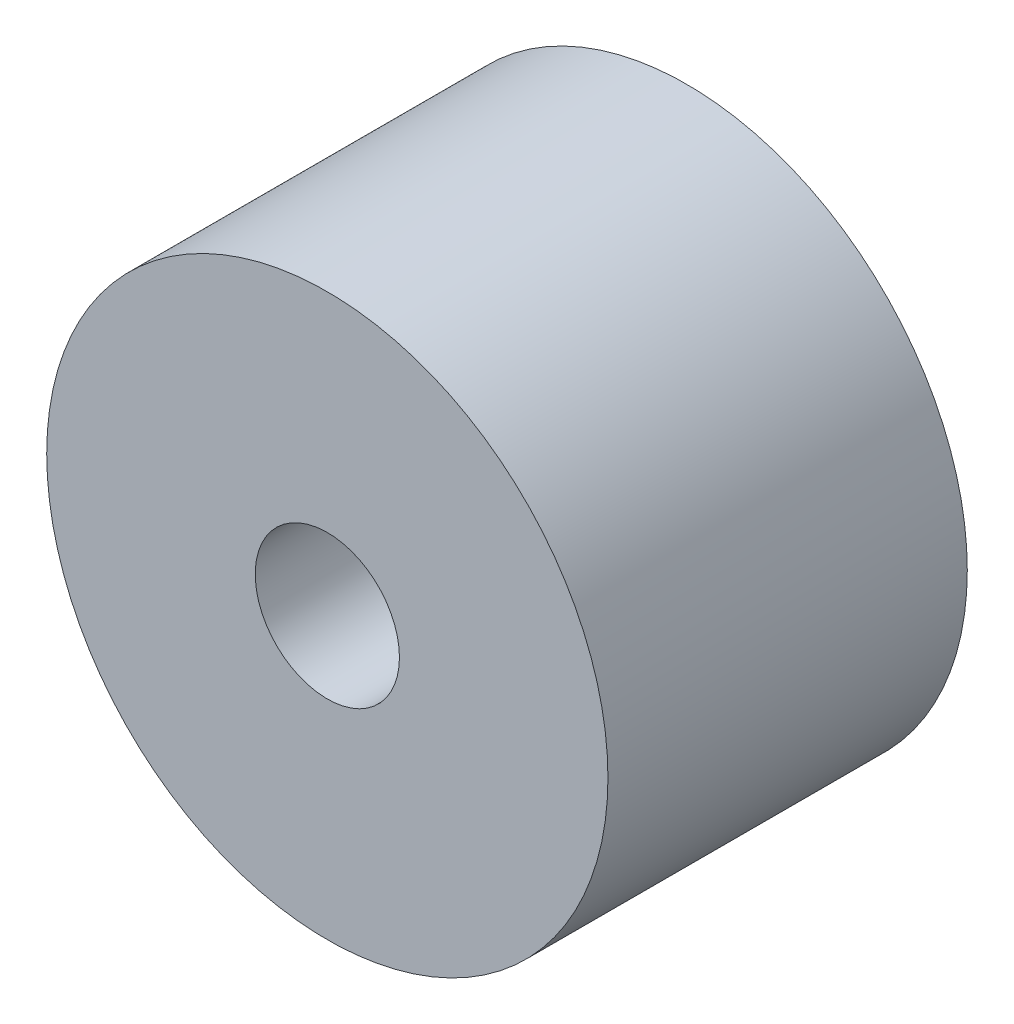
ISO-10303-21;
HEADER;
FILE_DESCRIPTION(('STEP AP214'),'2;1');
FILE_NAME('part.step','',(''),(''),'','','');
FILE_SCHEMA(('AUTOMOTIVE_DESIGN { 1 0 10303 214 1 1 1 1 }'));
ENDSEC;
DATA;
#1=APPLICATION_CONTEXT('core data for automotive mechanical design processes');
#2=APPLICATION_PROTOCOL_DEFINITION('international standard','automotive_design',2000,#1);
#3=PRODUCT_CONTEXT('',#1,'mechanical');
#4=PRODUCT('Part','Part','',(#3));
#5=PRODUCT_RELATED_PRODUCT_CATEGORY('part','',(#4));
#6=PRODUCT_DEFINITION_FORMATION('','',#4);
#7=PRODUCT_DEFINITION_CONTEXT('part definition',#1,'design');
#8=PRODUCT_DEFINITION('design','',#6,#7);
#9=PRODUCT_DEFINITION_SHAPE('','',#8);
#10=(LENGTH_UNIT() NAMED_UNIT(*) SI_UNIT(.MILLI.,.METRE.));
#11=(NAMED_UNIT(*) PLANE_ANGLE_UNIT() SI_UNIT($,.RADIAN.));
#12=(NAMED_UNIT(*) SI_UNIT($,.STERADIAN.) SOLID_ANGLE_UNIT());
#13=UNCERTAINTY_MEASURE_WITH_UNIT(LENGTH_MEASURE(1.E-05),#10,'distance_accuracy_value','');
#14=(GEOMETRIC_REPRESENTATION_CONTEXT(3) GLOBAL_UNCERTAINTY_ASSIGNED_CONTEXT((#13)) GLOBAL_UNIT_ASSIGNED_CONTEXT((#10,
#11,#12)) REPRESENTATION_CONTEXT('',''));
#15=CARTESIAN_POINT('',(0.,0.,0.));
#16=DIRECTION('',(0.,0.,1.));
#17=DIRECTION('',(1.,0.,0.));
#18=AXIS2_PLACEMENT_3D('',#15,#16,#17);
#19=CARTESIAN_POINT('',(0.,0.,2.99));
#20=DIRECTION('',(0.,0.,1.));
#21=DIRECTION('',(1.,0.,0.));
#22=AXIS2_PLACEMENT_3D('',#19,#20,#21);
#23=PLANE('',#22);
#24=CARTESIAN_POINT('',(0.,0.,2.99));
#25=DIRECTION('',(0.,0.,1.));
#26=DIRECTION('',(1.,0.,0.));
#27=AXIS2_PLACEMENT_3D('',#24,#25,#26);
#28=CIRCLE('',#27,2.335);
#29=CARTESIAN_POINT('',(2.335,0.,2.99));
#30=VERTEX_POINT('',#29);
#31=EDGE_CURVE('E10',#30,#30,#28,.T.);
#32=ORIENTED_EDGE('',*,*,#31,.T.);
#33=EDGE_LOOP('',(#32));
#34=FACE_BOUND('',#33,.T.);
#35=CARTESIAN_POINT('',(0.,0.,2.99));
#36=DIRECTION('',(0.,0.,1.));
#37=DIRECTION('',(1.,0.,0.));
#38=AXIS2_PLACEMENT_3D('',#35,#36,#37);
#39=CIRCLE('',#38,0.6);
#40=CARTESIAN_POINT('',(0.6,0.,2.99));
#41=VERTEX_POINT('',#40);
#42=EDGE_CURVE('E41',#41,#41,#39,.T.);
#43=ORIENTED_EDGE('',*,*,#42,.F.);
#44=EDGE_LOOP('',(#43));
#45=FACE_BOUND('',#44,.T.);
#46=ADVANCED_FACE('F30',(#34,#45),#23,.T.);
#47=CARTESIAN_POINT('',(0.,0.,0.));
#48=DIRECTION('',(0.,0.,1.));
#49=DIRECTION('',(1.,0.,0.));
#50=AXIS2_PLACEMENT_3D('',#47,#48,#49);
#51=PLANE('',#50);
#52=CARTESIAN_POINT('',(0.,0.,0.));
#53=DIRECTION('',(0.,0.,1.));
#54=DIRECTION('',(1.,0.,0.));
#55=AXIS2_PLACEMENT_3D('',#52,#53,#54);
#56=CIRCLE('',#55,2.335);
#57=CARTESIAN_POINT('',(2.335,0.,0.));
#58=VERTEX_POINT('',#57);
#59=EDGE_CURVE('E34',#58,#58,#56,.T.);
#60=ORIENTED_EDGE('',*,*,#59,.F.);
#61=EDGE_LOOP('',(#60));
#62=FACE_BOUND('',#61,.T.);
#63=CARTESIAN_POINT('',(0.,0.,0.));
#64=DIRECTION('',(0.,0.,1.));
#65=DIRECTION('',(1.,0.,0.));
#66=AXIS2_PLACEMENT_3D('',#63,#64,#65);
#67=CIRCLE('',#66,0.6);
#68=CARTESIAN_POINT('',(0.6,0.,0.));
#69=VERTEX_POINT('',#68);
#70=EDGE_CURVE('E43',#69,#69,#67,.T.);
#71=ORIENTED_EDGE('',*,*,#70,.T.);
#72=EDGE_LOOP('',(#71));
#73=FACE_BOUND('',#72,.T.);
#74=ADVANCED_FACE('F53',(#62,#73),#51,.F.);
#75=CARTESIAN_POINT('',(0.,0.,2.99));
#76=DIRECTION('',(0.,0.,-1.));
#77=DIRECTION('',(-1.,0.,0.));
#78=AXIS2_PLACEMENT_3D('',#75,#76,#77);
#79=CYLINDRICAL_SURFACE('',#78,2.335);
#80=ORIENTED_EDGE('',*,*,#31,.F.);
#81=EDGE_LOOP('',(#80));
#82=FACE_BOUND('',#81,.T.);
#83=ORIENTED_EDGE('',*,*,#59,.T.);
#84=EDGE_LOOP('',(#83));
#85=FACE_BOUND('',#84,.T.);
#86=ADVANCED_FACE('F32',(#82,#85),#79,.T.);
#87=CARTESIAN_POINT('',(0.,0.,2.99));
#88=DIRECTION('',(0.,0.,-1.));
#89=DIRECTION('',(-1.,0.,0.));
#90=AXIS2_PLACEMENT_3D('',#87,#88,#89);
#91=CYLINDRICAL_SURFACE('',#90,0.6);
#92=ORIENTED_EDGE('',*,*,#42,.T.);
#93=EDGE_LOOP('',(#92));
#94=FACE_BOUND('',#93,.T.);
#95=ORIENTED_EDGE('',*,*,#70,.F.);
#96=EDGE_LOOP('',(#95));
#97=FACE_BOUND('',#96,.T.);
#98=ADVANCED_FACE('F49',(#94,#97),#91,.F.);
#99=CLOSED_SHELL('',(#46,#74,#86,#98));
#100=MANIFOLD_SOLID_BREP('B2',#99);
#101=ADVANCED_BREP_SHAPE_REPRESENTATION('',(#18,#100),#14);
#102=SHAPE_DEFINITION_REPRESENTATION(#9,#101);
ENDSEC;
END-ISO-10303-21;
